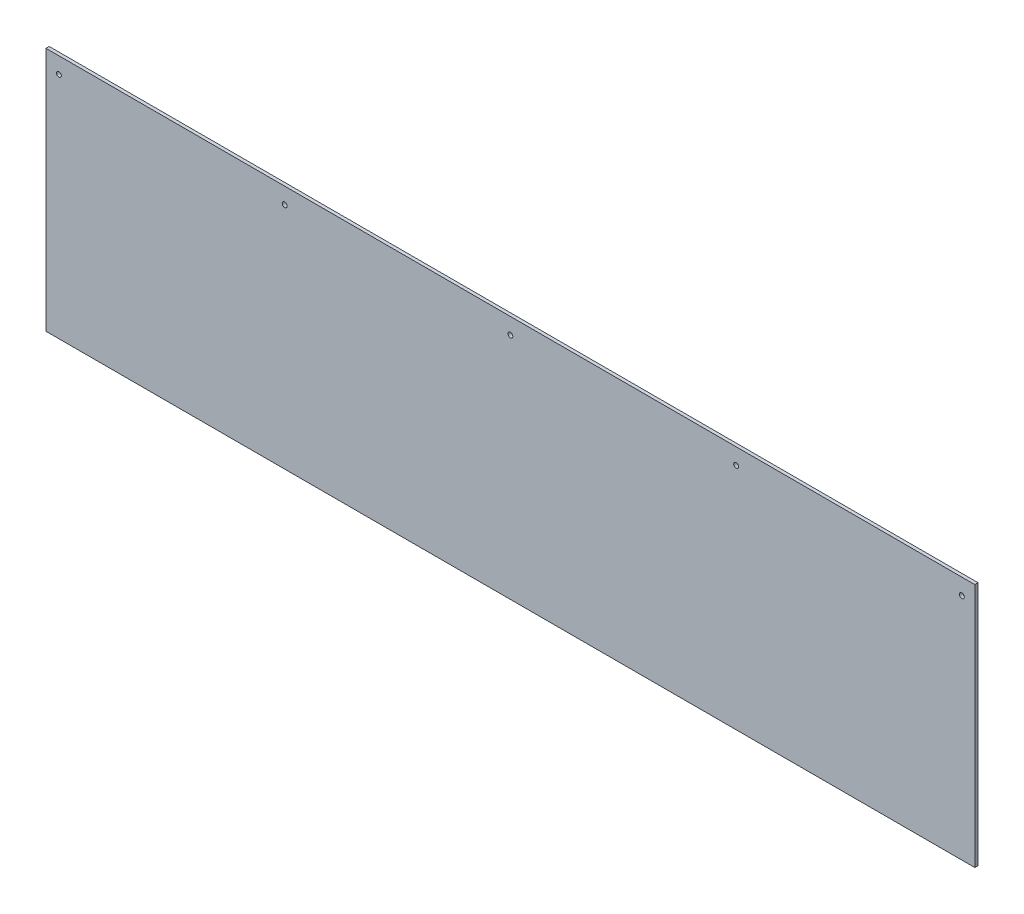
ISO-10303-21;
HEADER;
FILE_DESCRIPTION(('STEP AP214'),'2;1');
FILE_NAME('part.step','',(''),(''),'','','');
FILE_SCHEMA(('AUTOMOTIVE_DESIGN { 1 0 10303 214 1 1 1 1 }'));
ENDSEC;
DATA;
#1=APPLICATION_CONTEXT('core data for automotive mechanical design processes');
#2=APPLICATION_PROTOCOL_DEFINITION('international standard','automotive_design',2000,#1);
#3=PRODUCT_CONTEXT('',#1,'mechanical');
#4=PRODUCT('Part','Part','',(#3));
#5=PRODUCT_RELATED_PRODUCT_CATEGORY('part','',(#4));
#6=PRODUCT_DEFINITION_FORMATION('','',#4);
#7=PRODUCT_DEFINITION_CONTEXT('part definition',#1,'design');
#8=PRODUCT_DEFINITION('design','',#6,#7);
#9=PRODUCT_DEFINITION_SHAPE('','',#8);
#10=(LENGTH_UNIT() NAMED_UNIT(*) SI_UNIT(.MILLI.,.METRE.));
#11=(NAMED_UNIT(*) PLANE_ANGLE_UNIT() SI_UNIT($,.RADIAN.));
#12=(NAMED_UNIT(*) SI_UNIT($,.STERADIAN.) SOLID_ANGLE_UNIT());
#13=UNCERTAINTY_MEASURE_WITH_UNIT(LENGTH_MEASURE(1.E-05),#10,'distance_accuracy_value','');
#14=(GEOMETRIC_REPRESENTATION_CONTEXT(3) GLOBAL_UNCERTAINTY_ASSIGNED_CONTEXT((#13)) GLOBAL_UNIT_ASSIGNED_CONTEXT((#10,
#11,#12)) REPRESENTATION_CONTEXT('',''));
#15=CARTESIAN_POINT('',(0.,0.,0.));
#16=DIRECTION('',(0.,0.,1.));
#17=DIRECTION('',(1.,0.,0.));
#18=AXIS2_PLACEMENT_3D('',#15,#16,#17);
#19=CARTESIAN_POINT('',(0.,0.,6.35));
#20=DIRECTION('',(1.,0.,0.));
#21=DIRECTION('',(0.,0.,-1.));
#22=AXIS2_PLACEMENT_3D('',#19,#20,#21);
#23=PLANE('',#22);
#24=DIRECTION('',(0.,-1.,0.));
#25=VECTOR('',#24,1.);
#26=CARTESIAN_POINT('',(0.,0.,0.));
#27=LINE('',#26,#25);
#28=CARTESIAN_POINT('',(0.,482.6,0.));
#29=VERTEX_POINT('',#28);
#30=CARTESIAN_POINT('',(0.,0.,0.));
#31=VERTEX_POINT('',#30);
#32=EDGE_CURVE('E103',#29,#31,#27,.T.);
#33=ORIENTED_EDGE('',*,*,#32,.T.);
#34=DIRECTION('',(0.,0.,-1.));
#35=VECTOR('',#34,1.);
#36=CARTESIAN_POINT('',(0.,0.,6.35));
#37=LINE('',#36,#35);
#38=CARTESIAN_POINT('',(0.,0.,6.35));
#39=VERTEX_POINT('',#38);
#40=EDGE_CURVE('E11',#39,#31,#37,.T.);
#41=ORIENTED_EDGE('',*,*,#40,.F.);
#42=DIRECTION('',(0.,-1.,0.));
#43=VECTOR('',#42,1.);
#44=CARTESIAN_POINT('',(0.,0.,6.35));
#45=LINE('',#44,#43);
#46=CARTESIAN_POINT('',(0.,482.6,6.35));
#47=VERTEX_POINT('',#46);
#48=EDGE_CURVE('E89',#47,#39,#45,.T.);
#49=ORIENTED_EDGE('',*,*,#48,.F.);
#50=DIRECTION('',(0.,0.,-1.));
#51=VECTOR('',#50,1.);
#52=CARTESIAN_POINT('',(0.,482.6,6.35));
#53=LINE('',#52,#51);
#54=EDGE_CURVE('E99',#47,#29,#53,.T.);
#55=ORIENTED_EDGE('',*,*,#54,.T.);
#56=EDGE_LOOP('',(#33,#41,#49,#55));
#57=FACE_BOUND('',#56,.T.);
#58=ADVANCED_FACE('F38',(#57),#23,.F.);
#59=CARTESIAN_POINT('',(0.,0.,6.35));
#60=DIRECTION('',(0.,1.,0.));
#61=DIRECTION('',(0.,0.,1.));
#62=AXIS2_PLACEMENT_3D('',#59,#60,#61);
#63=PLANE('',#62);
#64=DIRECTION('',(1.,0.,0.));
#65=VECTOR('',#64,1.);
#66=CARTESIAN_POINT('',(0.,0.,0.));
#67=LINE('',#66,#65);
#68=CARTESIAN_POINT('',(1828.8,0.,0.));
#69=VERTEX_POINT('',#68);
#70=EDGE_CURVE('E94',#31,#69,#67,.T.);
#71=ORIENTED_EDGE('',*,*,#70,.T.);
#72=DIRECTION('',(0.,0.,-1.));
#73=VECTOR('',#72,1.);
#74=CARTESIAN_POINT('',(1828.8,0.,6.35));
#75=LINE('',#74,#73);
#76=CARTESIAN_POINT('',(1828.8,0.,6.35));
#77=VERTEX_POINT('',#76);
#78=EDGE_CURVE('E46',#77,#69,#75,.T.);
#79=ORIENTED_EDGE('',*,*,#78,.F.);
#80=DIRECTION('',(1.,0.,0.));
#81=VECTOR('',#80,1.);
#82=CARTESIAN_POINT('',(0.,0.,6.35));
#83=LINE('',#82,#81);
#84=EDGE_CURVE('E84',#39,#77,#83,.T.);
#85=ORIENTED_EDGE('',*,*,#84,.F.);
#86=ORIENTED_EDGE('',*,*,#40,.T.);
#87=EDGE_LOOP('',(#71,#79,#85,#86));
#88=FACE_BOUND('',#87,.T.);
#89=ADVANCED_FACE('F93',(#88),#63,.F.);
#90=CARTESIAN_POINT('',(1828.8,0.,6.35));
#91=DIRECTION('',(-1.,0.,0.));
#92=DIRECTION('',(0.,0.,1.));
#93=AXIS2_PLACEMENT_3D('',#90,#91,#92);
#94=PLANE('',#93);
#95=DIRECTION('',(0.,1.,0.));
#96=VECTOR('',#95,1.);
#97=CARTESIAN_POINT('',(1828.8,0.,0.));
#98=LINE('',#97,#96);
#99=CARTESIAN_POINT('',(1828.8,482.6,0.));
#100=VERTEX_POINT('',#99);
#101=EDGE_CURVE('E71',#69,#100,#98,.T.);
#102=ORIENTED_EDGE('',*,*,#101,.T.);
#103=DIRECTION('',(0.,0.,-1.));
#104=VECTOR('',#103,1.);
#105=CARTESIAN_POINT('',(1828.8,482.6,6.35));
#106=LINE('',#105,#104);
#107=CARTESIAN_POINT('',(1828.8,482.6,6.35));
#108=VERTEX_POINT('',#107);
#109=EDGE_CURVE('E95',#108,#100,#106,.T.);
#110=ORIENTED_EDGE('',*,*,#109,.F.);
#111=DIRECTION('',(0.,1.,0.));
#112=VECTOR('',#111,1.);
#113=CARTESIAN_POINT('',(1828.8,0.,6.35));
#114=LINE('',#113,#112);
#115=EDGE_CURVE('E87',#77,#108,#114,.T.);
#116=ORIENTED_EDGE('',*,*,#115,.F.);
#117=ORIENTED_EDGE('',*,*,#78,.T.);
#118=EDGE_LOOP('',(#102,#110,#116,#117));
#119=FACE_BOUND('',#118,.T.);
#120=ADVANCED_FACE('F96',(#119),#94,.F.);
#121=CARTESIAN_POINT('',(0.,482.6,6.35));
#122=DIRECTION('',(0.,-1.,0.));
#123=DIRECTION('',(1.,0.,0.));
#124=AXIS2_PLACEMENT_3D('',#121,#122,#123);
#125=PLANE('',#124);
#126=DIRECTION('',(-1.,0.,0.));
#127=VECTOR('',#126,1.);
#128=CARTESIAN_POINT('',(0.,482.6,0.));
#129=LINE('',#128,#127);
#130=EDGE_CURVE('E77',#100,#29,#129,.T.);
#131=ORIENTED_EDGE('',*,*,#130,.T.);
#132=ORIENTED_EDGE('',*,*,#54,.F.);
#133=DIRECTION('',(-1.,0.,0.));
#134=VECTOR('',#133,1.);
#135=CARTESIAN_POINT('',(0.,482.6,6.35));
#136=LINE('',#135,#134);
#137=EDGE_CURVE('E54',#108,#47,#136,.T.);
#138=ORIENTED_EDGE('',*,*,#137,.F.);
#139=ORIENTED_EDGE('',*,*,#109,.T.);
#140=EDGE_LOOP('',(#131,#132,#138,#139));
#141=FACE_BOUND('',#140,.T.);
#142=ADVANCED_FACE('F113',(#141),#125,.F.);
#143=CARTESIAN_POINT('',(0.,0.,6.35));
#144=DIRECTION('',(0.,0.,-1.));
#145=DIRECTION('',(-1.,0.,0.));
#146=AXIS2_PLACEMENT_3D('',#143,#144,#145);
#147=PLANE('',#146);
#148=CARTESIAN_POINT('',(25.4,450.85,6.35));
#149=DIRECTION('',(0.,0.,1.));
#150=DIRECTION('',(1.,0.,0.));
#151=AXIS2_PLACEMENT_3D('',#148,#149,#150);
#152=CIRCLE('',#151,4.7625);
#153=CARTESIAN_POINT('',(30.1625,450.85,6.35));
#154=VERTEX_POINT('',#153);
#155=EDGE_CURVE('E145',#154,#154,#152,.T.);
#156=ORIENTED_EDGE('',*,*,#155,.F.);
#157=EDGE_LOOP('',(#156));
#158=FACE_BOUND('',#157,.T.);
#159=CARTESIAN_POINT('',(469.9,450.85,6.35));
#160=DIRECTION('',(0.,0.,1.));
#161=DIRECTION('',(1.,0.,0.));
#162=AXIS2_PLACEMENT_3D('',#159,#160,#161);
#163=CIRCLE('',#162,4.76250000000001);
#164=CARTESIAN_POINT('',(474.6625,450.85,6.35));
#165=VERTEX_POINT('',#164);
#166=EDGE_CURVE('E139',#165,#165,#163,.T.);
#167=ORIENTED_EDGE('',*,*,#166,.F.);
#168=EDGE_LOOP('',(#167));
#169=FACE_BOUND('',#168,.T.);
#170=CARTESIAN_POINT('',(914.4,450.85,6.35));
#171=DIRECTION('',(0.,0.,1.));
#172=DIRECTION('',(1.,0.,0.));
#173=AXIS2_PLACEMENT_3D('',#170,#171,#172);
#174=CIRCLE('',#173,4.76250000000001);
#175=CARTESIAN_POINT('',(919.1625,450.85,6.35));
#176=VERTEX_POINT('',#175);
#177=EDGE_CURVE('E133',#176,#176,#174,.T.);
#178=ORIENTED_EDGE('',*,*,#177,.F.);
#179=EDGE_LOOP('',(#178));
#180=FACE_BOUND('',#179,.T.);
#181=CARTESIAN_POINT('',(1358.9,450.85,6.35));
#182=DIRECTION('',(0.,0.,1.));
#183=DIRECTION('',(1.,0.,0.));
#184=AXIS2_PLACEMENT_3D('',#181,#182,#183);
#185=CIRCLE('',#184,4.7624999999999);
#186=CARTESIAN_POINT('',(1363.6625,450.85,6.35));
#187=VERTEX_POINT('',#186);
#188=EDGE_CURVE('E125',#187,#187,#185,.T.);
#189=ORIENTED_EDGE('',*,*,#188,.F.);
#190=EDGE_LOOP('',(#189));
#191=FACE_BOUND('',#190,.T.);
#192=CARTESIAN_POINT('',(1803.4,450.85,6.35));
#193=DIRECTION('',(0.,0.,1.));
#194=DIRECTION('',(1.,0.,0.));
#195=AXIS2_PLACEMENT_3D('',#192,#193,#194);
#196=CIRCLE('',#195,4.7624999999999);
#197=CARTESIAN_POINT('',(1808.1625,450.85,6.35));
#198=VERTEX_POINT('',#197);
#199=EDGE_CURVE('E119',#198,#198,#196,.T.);
#200=ORIENTED_EDGE('',*,*,#199,.F.);
#201=EDGE_LOOP('',(#200));
#202=FACE_BOUND('',#201,.T.);
#203=ORIENTED_EDGE('',*,*,#48,.T.);
#204=ORIENTED_EDGE('',*,*,#84,.T.);
#205=ORIENTED_EDGE('',*,*,#115,.T.);
#206=ORIENTED_EDGE('',*,*,#137,.T.);
#207=EDGE_LOOP('',(#203,#204,#205,#206));
#208=FACE_BOUND('',#207,.T.);
#209=ADVANCED_FACE('F85',(#158,#169,#180,#191,#202,#208),#147,.F.);
#210=CARTESIAN_POINT('',(0.,0.,0.));
#211=DIRECTION('',(0.,0.,-1.));
#212=DIRECTION('',(-1.,0.,0.));
#213=AXIS2_PLACEMENT_3D('',#210,#211,#212);
#214=PLANE('',#213);
#215=CARTESIAN_POINT('',(25.4,450.85,0.));
#216=DIRECTION('',(0.,0.,1.));
#217=DIRECTION('',(1.,0.,0.));
#218=AXIS2_PLACEMENT_3D('',#215,#216,#217);
#219=CIRCLE('',#218,4.7625);
#220=CARTESIAN_POINT('',(30.1625,450.85,0.));
#221=VERTEX_POINT('',#220);
#222=EDGE_CURVE('E106',#221,#221,#219,.T.);
#223=ORIENTED_EDGE('',*,*,#222,.T.);
#224=EDGE_LOOP('',(#223));
#225=FACE_BOUND('',#224,.T.);
#226=CARTESIAN_POINT('',(469.9,450.85,0.));
#227=DIRECTION('',(0.,0.,1.));
#228=DIRECTION('',(1.,0.,0.));
#229=AXIS2_PLACEMENT_3D('',#226,#227,#228);
#230=CIRCLE('',#229,4.76250000000001);
#231=CARTESIAN_POINT('',(474.6625,450.85,0.));
#232=VERTEX_POINT('',#231);
#233=EDGE_CURVE('E142',#232,#232,#230,.T.);
#234=ORIENTED_EDGE('',*,*,#233,.T.);
#235=EDGE_LOOP('',(#234));
#236=FACE_BOUND('',#235,.T.);
#237=CARTESIAN_POINT('',(914.4,450.85,0.));
#238=DIRECTION('',(0.,0.,1.));
#239=DIRECTION('',(1.,0.,0.));
#240=AXIS2_PLACEMENT_3D('',#237,#238,#239);
#241=CIRCLE('',#240,4.76250000000001);
#242=CARTESIAN_POINT('',(919.1625,450.85,0.));
#243=VERTEX_POINT('',#242);
#244=EDGE_CURVE('E136',#243,#243,#241,.T.);
#245=ORIENTED_EDGE('',*,*,#244,.T.);
#246=EDGE_LOOP('',(#245));
#247=FACE_BOUND('',#246,.T.);
#248=CARTESIAN_POINT('',(1358.9,450.85,0.));
#249=DIRECTION('',(0.,0.,1.));
#250=DIRECTION('',(1.,0.,0.));
#251=AXIS2_PLACEMENT_3D('',#248,#249,#250);
#252=CIRCLE('',#251,4.7624999999999);
#253=CARTESIAN_POINT('',(1363.6625,450.85,0.));
#254=VERTEX_POINT('',#253);
#255=EDGE_CURVE('E129',#254,#254,#252,.T.);
#256=ORIENTED_EDGE('',*,*,#255,.T.);
#257=EDGE_LOOP('',(#256));
#258=FACE_BOUND('',#257,.T.);
#259=CARTESIAN_POINT('',(1803.4,450.85,0.));
#260=DIRECTION('',(0.,0.,1.));
#261=DIRECTION('',(1.,0.,0.));
#262=AXIS2_PLACEMENT_3D('',#259,#260,#261);
#263=CIRCLE('',#262,4.7624999999999);
#264=CARTESIAN_POINT('',(1808.1625,450.85,0.));
#265=VERTEX_POINT('',#264);
#266=EDGE_CURVE('E122',#265,#265,#263,.T.);
#267=ORIENTED_EDGE('',*,*,#266,.T.);
#268=EDGE_LOOP('',(#267));
#269=FACE_BOUND('',#268,.T.);
#270=ORIENTED_EDGE('',*,*,#32,.F.);
#271=ORIENTED_EDGE('',*,*,#130,.F.);
#272=ORIENTED_EDGE('',*,*,#101,.F.);
#273=ORIENTED_EDGE('',*,*,#70,.F.);
#274=EDGE_LOOP('',(#270,#271,#272,#273));
#275=FACE_BOUND('',#274,.T.);
#276=ADVANCED_FACE('F116',(#225,#236,#247,#258,#269,#275),#214,.T.);
#277=CARTESIAN_POINT('',(1803.4,450.85,0.));
#278=DIRECTION('',(0.,0.,1.));
#279=DIRECTION('',(1.,0.,0.));
#280=AXIS2_PLACEMENT_3D('',#277,#278,#279);
#281=CYLINDRICAL_SURFACE('',#280,4.7624999999999);
#282=ORIENTED_EDGE('',*,*,#266,.F.);
#283=EDGE_LOOP('',(#282));
#284=FACE_BOUND('',#283,.T.);
#285=ORIENTED_EDGE('',*,*,#199,.T.);
#286=EDGE_LOOP('',(#285));
#287=FACE_BOUND('',#286,.T.);
#288=ADVANCED_FACE('F171',(#284,#287),#281,.F.);
#289=CARTESIAN_POINT('',(1358.9,450.85,0.));
#290=DIRECTION('',(0.,0.,1.));
#291=DIRECTION('',(1.,0.,0.));
#292=AXIS2_PLACEMENT_3D('',#289,#290,#291);
#293=CYLINDRICAL_SURFACE('',#292,4.7624999999999);
#294=ORIENTED_EDGE('',*,*,#255,.F.);
#295=EDGE_LOOP('',(#294));
#296=FACE_BOUND('',#295,.T.);
#297=ORIENTED_EDGE('',*,*,#188,.T.);
#298=EDGE_LOOP('',(#297));
#299=FACE_BOUND('',#298,.T.);
#300=ADVANCED_FACE('F173',(#296,#299),#293,.F.);
#301=CARTESIAN_POINT('',(914.4,450.85,0.));
#302=DIRECTION('',(0.,0.,1.));
#303=DIRECTION('',(1.,0.,0.));
#304=AXIS2_PLACEMENT_3D('',#301,#302,#303);
#305=CYLINDRICAL_SURFACE('',#304,4.76250000000001);
#306=ORIENTED_EDGE('',*,*,#244,.F.);
#307=EDGE_LOOP('',(#306));
#308=FACE_BOUND('',#307,.T.);
#309=ORIENTED_EDGE('',*,*,#177,.T.);
#310=EDGE_LOOP('',(#309));
#311=FACE_BOUND('',#310,.T.);
#312=ADVANCED_FACE('F180',(#308,#311),#305,.F.);
#313=CARTESIAN_POINT('',(469.9,450.85,0.));
#314=DIRECTION('',(0.,0.,1.));
#315=DIRECTION('',(1.,0.,0.));
#316=AXIS2_PLACEMENT_3D('',#313,#314,#315);
#317=CYLINDRICAL_SURFACE('',#316,4.76250000000001);
#318=ORIENTED_EDGE('',*,*,#233,.F.);
#319=EDGE_LOOP('',(#318));
#320=FACE_BOUND('',#319,.T.);
#321=ORIENTED_EDGE('',*,*,#166,.T.);
#322=EDGE_LOOP('',(#321));
#323=FACE_BOUND('',#322,.T.);
#324=ADVANCED_FACE('F156',(#320,#323),#317,.F.);
#325=CARTESIAN_POINT('',(25.4,450.85,0.));
#326=DIRECTION('',(0.,0.,1.));
#327=DIRECTION('',(1.,0.,0.));
#328=AXIS2_PLACEMENT_3D('',#325,#326,#327);
#329=CYLINDRICAL_SURFACE('',#328,4.7625);
#330=ORIENTED_EDGE('',*,*,#222,.F.);
#331=EDGE_LOOP('',(#330));
#332=FACE_BOUND('',#331,.T.);
#333=ORIENTED_EDGE('',*,*,#155,.T.);
#334=EDGE_LOOP('',(#333));
#335=FACE_BOUND('',#334,.T.);
#336=ADVANCED_FACE('F153',(#332,#335),#329,.F.);
#337=CLOSED_SHELL('',(#58,#89,#120,#142,#209,#276,#288,#300,#312,#324,#336));
#338=MANIFOLD_SOLID_BREP('B2',#337);
#339=ADVANCED_BREP_SHAPE_REPRESENTATION('',(#18,#338),#14);
#340=SHAPE_DEFINITION_REPRESENTATION(#9,#339);
ENDSEC;
END-ISO-10303-21;
